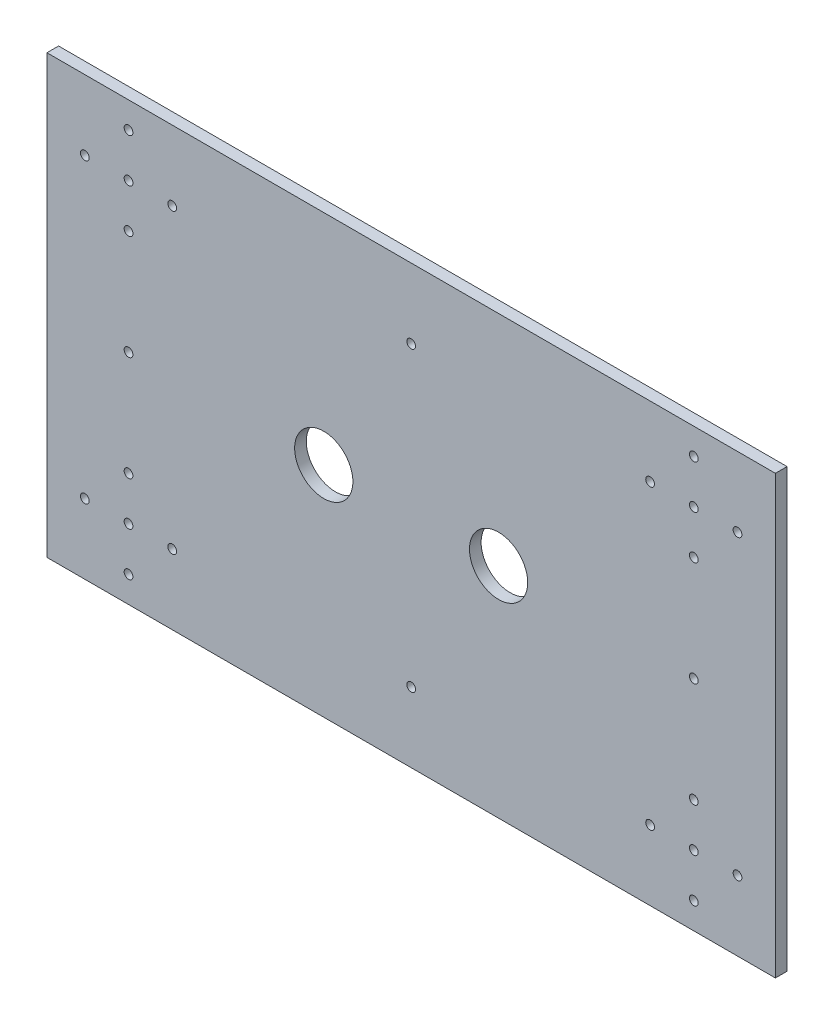
ISO-10303-21;
HEADER;
FILE_DESCRIPTION(('STEP AP214'),'2;1');
FILE_NAME('part.step','',(''),(''),'','','');
FILE_SCHEMA(('AUTOMOTIVE_DESIGN { 1 0 10303 214 1 1 1 1 }'));
ENDSEC;
DATA;
#1=APPLICATION_CONTEXT('core data for automotive mechanical design processes');
#2=APPLICATION_PROTOCOL_DEFINITION('international standard','automotive_design',2000,#1);
#3=PRODUCT_CONTEXT('',#1,'mechanical');
#4=PRODUCT('Part','Part','',(#3));
#5=PRODUCT_RELATED_PRODUCT_CATEGORY('part','',(#4));
#6=PRODUCT_DEFINITION_FORMATION('','',#4);
#7=PRODUCT_DEFINITION_CONTEXT('part definition',#1,'design');
#8=PRODUCT_DEFINITION('design','',#6,#7);
#9=PRODUCT_DEFINITION_SHAPE('','',#8);
#10=(LENGTH_UNIT() NAMED_UNIT(*) SI_UNIT(.MILLI.,.METRE.));
#11=(NAMED_UNIT(*) PLANE_ANGLE_UNIT() SI_UNIT($,.RADIAN.));
#12=(NAMED_UNIT(*) SI_UNIT($,.STERADIAN.) SOLID_ANGLE_UNIT());
#13=UNCERTAINTY_MEASURE_WITH_UNIT(LENGTH_MEASURE(1.E-05),#10,'distance_accuracy_value','');
#14=(GEOMETRIC_REPRESENTATION_CONTEXT(3) GLOBAL_UNCERTAINTY_ASSIGNED_CONTEXT((#13)) GLOBAL_UNIT_ASSIGNED_CONTEXT((#10,
#11,#12)) REPRESENTATION_CONTEXT('',''));
#15=CARTESIAN_POINT('',(0.,0.,0.));
#16=DIRECTION('',(0.,0.,1.));
#17=DIRECTION('',(1.,0.,0.));
#18=AXIS2_PLACEMENT_3D('',#15,#16,#17);
#19=CARTESIAN_POINT('',(0.,0.,4.));
#20=DIRECTION('',(0.,0.,1.));
#21=DIRECTION('',(1.,0.,0.));
#22=AXIS2_PLACEMENT_3D('',#19,#20,#21);
#23=PLANE('',#22);
#24=CARTESIAN_POINT('',(94.9015025860532,-41.1333333333333,4.));
#25=DIRECTION('',(0.,0.,1.));
#26=DIRECTION('',(1.,0.,0.));
#27=AXIS2_PLACEMENT_3D('',#24,#25,#26);
#28=CIRCLE('',#27,10.);
#29=CARTESIAN_POINT('',(104.901502586053,-41.1333333333333,4.));
#30=VERTEX_POINT('',#29);
#31=EDGE_CURVE('E253',#30,#30,#28,.T.);
#32=ORIENTED_EDGE('',*,*,#31,.F.);
#33=EDGE_LOOP('',(#32));
#34=FACE_BOUND('',#33,.T.);
#35=CARTESIAN_POINT('',(-32.098497413947,24.8666666666667,4.));
#36=DIRECTION('',(0.,0.,1.));
#37=DIRECTION('',(1.,0.,0.));
#38=AXIS2_PLACEMENT_3D('',#35,#36,#37);
#39=CIRCLE('',#38,1.50000000000001);
#40=CARTESIAN_POINT('',(-30.598497413947,24.8666666666667,4.));
#41=VERTEX_POINT('',#40);
#42=EDGE_CURVE('E241',#41,#41,#39,.T.);
#43=ORIENTED_EDGE('',*,*,#42,.F.);
#44=EDGE_LOOP('',(#43));
#45=FACE_BOUND('',#44,.T.);
#46=CARTESIAN_POINT('',(-32.0984974139472,-5.13333333333334,4.));
#47=DIRECTION('',(0.,0.,1.));
#48=DIRECTION('',(1.,0.,0.));
#49=AXIS2_PLACEMENT_3D('',#46,#47,#48);
#50=CIRCLE('',#49,1.5);
#51=CARTESIAN_POINT('',(-30.5984974139472,-5.13333333333334,4.));
#52=VERTEX_POINT('',#51);
#53=EDGE_CURVE('E229',#52,#52,#50,.T.);
#54=ORIENTED_EDGE('',*,*,#53,.F.);
#55=EDGE_LOOP('',(#54));
#56=FACE_BOUND('',#55,.T.);
#57=CARTESIAN_POINT('',(-32.0984974139472,9.86666666666666,4.));
#58=DIRECTION('',(0.,0.,1.));
#59=DIRECTION('',(1.,0.,0.));
#60=AXIS2_PLACEMENT_3D('',#57,#58,#59);
#61=CIRCLE('',#60,1.5);
#62=CARTESIAN_POINT('',(-30.5984974139472,9.86666666666666,4.));
#63=VERTEX_POINT('',#62);
#64=EDGE_CURVE('E217',#63,#63,#61,.T.);
#65=ORIENTED_EDGE('',*,*,#64,.F.);
#66=EDGE_LOOP('',(#65));
#67=FACE_BOUND('',#66,.T.);
#68=CARTESIAN_POINT('',(146.901502586053,9.86666666666676,4.));
#69=DIRECTION('',(0.,0.,1.));
#70=DIRECTION('',(1.,0.,0.));
#71=AXIS2_PLACEMENT_3D('',#68,#69,#70);
#72=CIRCLE('',#71,1.49999999999999);
#73=CARTESIAN_POINT('',(148.401502586053,9.86666666666676,4.));
#74=VERTEX_POINT('',#73);
#75=EDGE_CURVE('E205',#74,#74,#72,.T.);
#76=ORIENTED_EDGE('',*,*,#75,.F.);
#77=EDGE_LOOP('',(#76));
#78=FACE_BOUND('',#77,.T.);
#79=CARTESIAN_POINT('',(176.901502586053,9.86666666666666,4.));
#80=DIRECTION('',(0.,0.,1.));
#81=DIRECTION('',(1.,0.,0.));
#82=AXIS2_PLACEMENT_3D('',#79,#80,#81);
#83=CIRCLE('',#82,1.5);
#84=CARTESIAN_POINT('',(178.401502586053,9.86666666666666,4.));
#85=VERTEX_POINT('',#84);
#86=EDGE_CURVE('E193',#85,#85,#83,.T.);
#87=ORIENTED_EDGE('',*,*,#86,.F.);
#88=EDGE_LOOP('',(#87));
#89=FACE_BOUND('',#88,.T.);
#90=CARTESIAN_POINT('',(161.901502586053,-77.1333333333333,4.));
#91=DIRECTION('',(0.,0.,1.));
#92=DIRECTION('',(1.,0.,0.));
#93=AXIS2_PLACEMENT_3D('',#90,#91,#92);
#94=CIRCLE('',#93,1.5);
#95=CARTESIAN_POINT('',(163.401502586053,-77.1333333333333,4.));
#96=VERTEX_POINT('',#95);
#97=EDGE_CURVE('E181',#96,#96,#94,.T.);
#98=ORIENTED_EDGE('',*,*,#97,.F.);
#99=EDGE_LOOP('',(#98));
#100=FACE_BOUND('',#99,.T.);
#101=CARTESIAN_POINT('',(161.901502586053,-107.133333333333,4.));
#102=DIRECTION('',(0.,0.,1.));
#103=DIRECTION('',(1.,0.,0.));
#104=AXIS2_PLACEMENT_3D('',#101,#102,#103);
#105=CIRCLE('',#104,1.5);
#106=CARTESIAN_POINT('',(163.401502586053,-107.133333333333,4.));
#107=VERTEX_POINT('',#106);
#108=EDGE_CURVE('E169',#107,#107,#105,.T.);
#109=ORIENTED_EDGE('',*,*,#108,.F.);
#110=EDGE_LOOP('',(#109));
#111=FACE_BOUND('',#110,.T.);
#112=CARTESIAN_POINT('',(161.901502586053,-92.1333333333333,4.));
#113=DIRECTION('',(0.,0.,1.));
#114=DIRECTION('',(1.,0.,0.));
#115=AXIS2_PLACEMENT_3D('',#112,#113,#114);
#116=CIRCLE('',#115,1.5);
#117=CARTESIAN_POINT('',(163.401502586053,-92.1333333333333,4.));
#118=VERTEX_POINT('',#117);
#119=EDGE_CURVE('E157',#118,#118,#116,.T.);
#120=ORIENTED_EDGE('',*,*,#119,.F.);
#121=EDGE_LOOP('',(#120));
#122=FACE_BOUND('',#121,.T.);
#123=CARTESIAN_POINT('',(-32.0984974139467,-77.1333333333333,4.));
#124=DIRECTION('',(0.,0.,1.));
#125=DIRECTION('',(1.,0.,0.));
#126=AXIS2_PLACEMENT_3D('',#123,#124,#125);
#127=CIRCLE('',#126,1.50000000000001);
#128=CARTESIAN_POINT('',(-30.5984974139467,-77.1333333333333,4.));
#129=VERTEX_POINT('',#128);
#130=EDGE_CURVE('E145',#129,#129,#127,.T.);
#131=ORIENTED_EDGE('',*,*,#130,.F.);
#132=EDGE_LOOP('',(#131));
#133=FACE_BOUND('',#132,.T.);
#134=CARTESIAN_POINT('',(161.901502586053,-41.1333333333333,4.));
#135=DIRECTION('',(0.,0.,1.));
#136=DIRECTION('',(1.,0.,0.));
#137=AXIS2_PLACEMENT_3D('',#134,#135,#136);
#138=CIRCLE('',#137,1.5);
#139=CARTESIAN_POINT('',(163.401502586053,-41.1333333333333,4.));
#140=VERTEX_POINT('',#139);
#141=EDGE_CURVE('E133',#140,#140,#138,.T.);
#142=ORIENTED_EDGE('',*,*,#141,.F.);
#143=EDGE_LOOP('',(#142));
#144=FACE_BOUND('',#143,.T.);
#145=CARTESIAN_POINT('',(-17.0984974139468,-92.1333333333333,4.));
#146=DIRECTION('',(0.,0.,1.));
#147=DIRECTION('',(1.,0.,0.));
#148=AXIS2_PLACEMENT_3D('',#145,#146,#147);
#149=CIRCLE('',#148,1.5);
#150=CARTESIAN_POINT('',(-15.5984974139468,-92.1333333333333,4.));
#151=VERTEX_POINT('',#150);
#152=EDGE_CURVE('E121',#151,#151,#149,.T.);
#153=ORIENTED_EDGE('',*,*,#152,.F.);
#154=EDGE_LOOP('',(#153));
#155=FACE_BOUND('',#154,.T.);
#156=CARTESIAN_POINT('',(-32.0984974139472,-41.1333333333333,4.));
#157=DIRECTION('',(0.,0.,1.));
#158=DIRECTION('',(1.,0.,0.));
#159=AXIS2_PLACEMENT_3D('',#156,#157,#158);
#160=CIRCLE('',#159,1.5);
#161=CARTESIAN_POINT('',(-30.5984974139472,-41.1333333333333,4.));
#162=VERTEX_POINT('',#161);
#163=EDGE_CURVE('E100',#162,#162,#160,.T.);
#164=ORIENTED_EDGE('',*,*,#163,.F.);
#165=EDGE_LOOP('',(#164));
#166=FACE_BOUND('',#165,.T.);
#167=DIRECTION('',(0.,-1.,0.));
#168=VECTOR('',#167,1.);
#169=CARTESIAN_POINT('',(-60.0984974139469,33.8666666666667,4.));
#170=LINE('',#169,#168);
#171=CARTESIAN_POINT('',(-60.0984974139469,33.8666666666667,4.));
#172=VERTEX_POINT('',#171);
#173=CARTESIAN_POINT('',(-60.0984974139469,-116.133333333333,4.));
#174=VERTEX_POINT('',#173);
#175=EDGE_CURVE('E85',#172,#174,#170,.T.);
#176=ORIENTED_EDGE('',*,*,#175,.T.);
#177=DIRECTION('',(1.,0.,0.));
#178=VECTOR('',#177,1.);
#179=CARTESIAN_POINT('',(-60.0984974139469,-116.133333333333,4.));
#180=LINE('',#179,#178);
#181=CARTESIAN_POINT('',(189.901502586053,-116.133333333333,4.));
#182=VERTEX_POINT('',#181);
#183=EDGE_CURVE('E80',#174,#182,#180,.T.);
#184=ORIENTED_EDGE('',*,*,#183,.T.);
#185=DIRECTION('',(0.,1.,0.));
#186=VECTOR('',#185,1.);
#187=CARTESIAN_POINT('',(189.901502586053,33.8666666666667,4.));
#188=LINE('',#187,#186);
#189=CARTESIAN_POINT('',(189.901502586053,33.8666666666667,4.));
#190=VERTEX_POINT('',#189);
#191=EDGE_CURVE('E83',#182,#190,#188,.T.);
#192=ORIENTED_EDGE('',*,*,#191,.T.);
#193=DIRECTION('',(-1.,0.,0.));
#194=VECTOR('',#193,1.);
#195=CARTESIAN_POINT('',(-60.0984974139469,33.8666666666667,4.));
#196=LINE('',#195,#194);
#197=EDGE_CURVE('E50',#190,#172,#196,.T.);
#198=ORIENTED_EDGE('',*,*,#197,.T.);
#199=EDGE_LOOP('',(#176,#184,#192,#198));
#200=FACE_BOUND('',#199,.T.);
#201=CARTESIAN_POINT('',(-32.0984974139468,-92.1333333333333,4.));
#202=DIRECTION('',(0.,0.,1.));
#203=DIRECTION('',(1.,0.,0.));
#204=AXIS2_PLACEMENT_3D('',#201,#202,#203);
#205=CIRCLE('',#204,1.5);
#206=CARTESIAN_POINT('',(-30.5984974139468,-92.1333333333333,4.));
#207=VERTEX_POINT('',#206);
#208=EDGE_CURVE('E115',#207,#207,#205,.T.);
#209=ORIENTED_EDGE('',*,*,#208,.F.);
#210=EDGE_LOOP('',(#209));
#211=FACE_BOUND('',#210,.T.);
#212=CARTESIAN_POINT('',(-32.0984974139469,-107.133333333333,4.));
#213=DIRECTION('',(0.,0.,1.));
#214=DIRECTION('',(1.,0.,0.));
#215=AXIS2_PLACEMENT_3D('',#212,#213,#214);
#216=CIRCLE('',#215,1.5);
#217=CARTESIAN_POINT('',(-30.5984974139469,-107.133333333333,4.));
#218=VERTEX_POINT('',#217);
#219=EDGE_CURVE('E127',#218,#218,#216,.T.);
#220=ORIENTED_EDGE('',*,*,#219,.F.);
#221=EDGE_LOOP('',(#220));
#222=FACE_BOUND('',#221,.T.);
#223=CARTESIAN_POINT('',(-47.0984974139468,-92.1333333333332,4.));
#224=DIRECTION('',(0.,0.,1.));
#225=DIRECTION('',(1.,0.,0.));
#226=AXIS2_PLACEMENT_3D('',#223,#224,#225);
#227=CIRCLE('',#226,1.49999999999999);
#228=CARTESIAN_POINT('',(-45.5984974139468,-92.1333333333332,4.));
#229=VERTEX_POINT('',#228);
#230=EDGE_CURVE('E139',#229,#229,#227,.T.);
#231=ORIENTED_EDGE('',*,*,#230,.F.);
#232=EDGE_LOOP('',(#231));
#233=FACE_BOUND('',#232,.T.);
#234=CARTESIAN_POINT('',(64.9015025860531,9.86666666666666,4.));
#235=DIRECTION('',(0.,0.,1.));
#236=DIRECTION('',(1.,0.,0.));
#237=AXIS2_PLACEMENT_3D('',#234,#235,#236);
#238=CIRCLE('',#237,1.5);
#239=CARTESIAN_POINT('',(66.4015025860531,9.86666666666666,4.));
#240=VERTEX_POINT('',#239);
#241=EDGE_CURVE('E151',#240,#240,#238,.T.);
#242=ORIENTED_EDGE('',*,*,#241,.F.);
#243=EDGE_LOOP('',(#242));
#244=FACE_BOUND('',#243,.T.);
#245=CARTESIAN_POINT('',(176.901502586053,-92.1333333333333,4.));
#246=DIRECTION('',(0.,0.,1.));
#247=DIRECTION('',(1.,0.,0.));
#248=AXIS2_PLACEMENT_3D('',#245,#246,#247);
#249=CIRCLE('',#248,1.5);
#250=CARTESIAN_POINT('',(178.401502586053,-92.1333333333333,4.));
#251=VERTEX_POINT('',#250);
#252=EDGE_CURVE('E163',#251,#251,#249,.T.);
#253=ORIENTED_EDGE('',*,*,#252,.F.);
#254=EDGE_LOOP('',(#253));
#255=FACE_BOUND('',#254,.T.);
#256=CARTESIAN_POINT('',(146.901502586053,-92.1333333333332,4.));
#257=DIRECTION('',(0.,0.,1.));
#258=DIRECTION('',(1.,0.,0.));
#259=AXIS2_PLACEMENT_3D('',#256,#257,#258);
#260=CIRCLE('',#259,1.49999999999999);
#261=CARTESIAN_POINT('',(148.401502586053,-92.1333333333332,4.));
#262=VERTEX_POINT('',#261);
#263=EDGE_CURVE('E175',#262,#262,#260,.T.);
#264=ORIENTED_EDGE('',*,*,#263,.F.);
#265=EDGE_LOOP('',(#264));
#266=FACE_BOUND('',#265,.T.);
#267=CARTESIAN_POINT('',(161.901502586053,9.86666666666666,4.));
#268=DIRECTION('',(0.,0.,1.));
#269=DIRECTION('',(1.,0.,0.));
#270=AXIS2_PLACEMENT_3D('',#267,#268,#269);
#271=CIRCLE('',#270,1.50000000000002);
#272=CARTESIAN_POINT('',(163.401502586053,9.86666666666666,4.));
#273=VERTEX_POINT('',#272);
#274=EDGE_CURVE('E187',#273,#273,#271,.T.);
#275=ORIENTED_EDGE('',*,*,#274,.F.);
#276=EDGE_LOOP('',(#275));
#277=FACE_BOUND('',#276,.T.);
#278=CARTESIAN_POINT('',(161.901502586053,-5.13333333333334,4.));
#279=DIRECTION('',(0.,0.,1.));
#280=DIRECTION('',(1.,0.,0.));
#281=AXIS2_PLACEMENT_3D('',#278,#279,#280);
#282=CIRCLE('',#281,1.5);
#283=CARTESIAN_POINT('',(163.401502586053,-5.13333333333334,4.));
#284=VERTEX_POINT('',#283);
#285=EDGE_CURVE('E199',#284,#284,#282,.T.);
#286=ORIENTED_EDGE('',*,*,#285,.F.);
#287=EDGE_LOOP('',(#286));
#288=FACE_BOUND('',#287,.T.);
#289=CARTESIAN_POINT('',(161.901502586053,24.8666666666667,4.));
#290=DIRECTION('',(0.,0.,1.));
#291=DIRECTION('',(1.,0.,0.));
#292=AXIS2_PLACEMENT_3D('',#289,#290,#291);
#293=CIRCLE('',#292,1.50000000000001);
#294=CARTESIAN_POINT('',(163.401502586053,24.8666666666667,4.));
#295=VERTEX_POINT('',#294);
#296=EDGE_CURVE('E211',#295,#295,#293,.T.);
#297=ORIENTED_EDGE('',*,*,#296,.F.);
#298=EDGE_LOOP('',(#297));
#299=FACE_BOUND('',#298,.T.);
#300=CARTESIAN_POINT('',(-17.0984974139472,9.86666666666666,4.));
#301=DIRECTION('',(0.,0.,1.));
#302=DIRECTION('',(1.,0.,0.));
#303=AXIS2_PLACEMENT_3D('',#300,#301,#302);
#304=CIRCLE('',#303,1.5);
#305=CARTESIAN_POINT('',(-15.5984974139472,9.86666666666666,4.));
#306=VERTEX_POINT('',#305);
#307=EDGE_CURVE('E223',#306,#306,#304,.T.);
#308=ORIENTED_EDGE('',*,*,#307,.F.);
#309=EDGE_LOOP('',(#308));
#310=FACE_BOUND('',#309,.T.);
#311=CARTESIAN_POINT('',(-47.0984974139472,9.86666666666676,4.));
#312=DIRECTION('',(0.,0.,1.));
#313=DIRECTION('',(1.,0.,0.));
#314=AXIS2_PLACEMENT_3D('',#311,#312,#313);
#315=CIRCLE('',#314,1.49999999999999);
#316=CARTESIAN_POINT('',(-45.5984974139472,9.86666666666676,4.));
#317=VERTEX_POINT('',#316);
#318=EDGE_CURVE('E235',#317,#317,#315,.T.);
#319=ORIENTED_EDGE('',*,*,#318,.F.);
#320=EDGE_LOOP('',(#319));
#321=FACE_BOUND('',#320,.T.);
#322=CARTESIAN_POINT('',(64.9015025860542,-92.1333333333333,4.));
#323=DIRECTION('',(0.,0.,1.));
#324=DIRECTION('',(1.,0.,0.));
#325=AXIS2_PLACEMENT_3D('',#322,#323,#324);
#326=CIRCLE('',#325,1.5);
#327=CARTESIAN_POINT('',(66.4015025860542,-92.1333333333333,4.));
#328=VERTEX_POINT('',#327);
#329=EDGE_CURVE('E247',#328,#328,#326,.T.);
#330=ORIENTED_EDGE('',*,*,#329,.F.);
#331=EDGE_LOOP('',(#330));
#332=FACE_BOUND('',#331,.T.);
#333=CARTESIAN_POINT('',(34.9015025860531,-41.1333333333333,4.));
#334=DIRECTION('',(0.,0.,1.));
#335=DIRECTION('',(-1.,0.,0.));
#336=AXIS2_PLACEMENT_3D('',#333,#334,#335);
#337=CIRCLE('',#336,10.);
#338=CARTESIAN_POINT('',(24.9015025860531,-41.1333333333333,4.));
#339=VERTEX_POINT('',#338);
#340=EDGE_CURVE('E259',#339,#339,#337,.T.);
#341=ORIENTED_EDGE('',*,*,#340,.F.);
#342=EDGE_LOOP('',(#341));
#343=FACE_BOUND('',#342,.T.);
#344=ADVANCED_FACE('F33',(#34,#45,#56,#67,#78,#89,#100,#111,#122,#133,#144,#155,#166,#200,#211,
#222,#233,#244,#255,#266,#277,#288,#299,#310,#321,#332,#343),#23,.T.);
#345=CARTESIAN_POINT('',(0.,0.,0.));
#346=DIRECTION('',(0.,0.,1.));
#347=DIRECTION('',(1.,0.,0.));
#348=AXIS2_PLACEMENT_3D('',#345,#346,#347);
#349=PLANE('',#348);
#350=DIRECTION('',(0.,-1.,0.));
#351=VECTOR('',#350,1.);
#352=CARTESIAN_POINT('',(-60.0984974139469,33.8666666666667,0.));
#353=LINE('',#352,#351);
#354=CARTESIAN_POINT('',(-60.0984974139469,33.8666666666667,0.));
#355=VERTEX_POINT('',#354);
#356=CARTESIAN_POINT('',(-60.0984974139469,-116.133333333333,0.));
#357=VERTEX_POINT('',#356);
#358=EDGE_CURVE('E97',#355,#357,#353,.T.);
#359=ORIENTED_EDGE('',*,*,#358,.F.);
#360=DIRECTION('',(-1.,0.,0.));
#361=VECTOR('',#360,1.);
#362=CARTESIAN_POINT('',(-60.0984974139469,33.8666666666667,0.));
#363=LINE('',#362,#361);
#364=CARTESIAN_POINT('',(189.901502586053,33.8666666666667,0.));
#365=VERTEX_POINT('',#364);
#366=EDGE_CURVE('E73',#365,#355,#363,.T.);
#367=ORIENTED_EDGE('',*,*,#366,.F.);
#368=DIRECTION('',(0.,1.,0.));
#369=VECTOR('',#368,1.);
#370=CARTESIAN_POINT('',(189.901502586053,33.8666666666667,0.));
#371=LINE('',#370,#369);
#372=CARTESIAN_POINT('',(189.901502586053,-116.133333333333,0.));
#373=VERTEX_POINT('',#372);
#374=EDGE_CURVE('E67',#373,#365,#371,.T.);
#375=ORIENTED_EDGE('',*,*,#374,.F.);
#376=DIRECTION('',(1.,0.,0.));
#377=VECTOR('',#376,1.);
#378=CARTESIAN_POINT('',(-60.0984974139469,-116.133333333333,0.));
#379=LINE('',#378,#377);
#380=EDGE_CURVE('E89',#357,#373,#379,.T.);
#381=ORIENTED_EDGE('',*,*,#380,.F.);
#382=EDGE_LOOP('',(#359,#367,#375,#381));
#383=FACE_BOUND('',#382,.T.);
#384=CARTESIAN_POINT('',(-32.0984974139472,-41.1333333333333,0.));
#385=DIRECTION('',(0.,0.,1.));
#386=DIRECTION('',(1.,0.,0.));
#387=AXIS2_PLACEMENT_3D('',#384,#385,#386);
#388=CIRCLE('',#387,1.5);
#389=CARTESIAN_POINT('',(-30.5984974139472,-41.1333333333333,0.));
#390=VERTEX_POINT('',#389);
#391=EDGE_CURVE('E112',#390,#390,#388,.T.);
#392=ORIENTED_EDGE('',*,*,#391,.T.);
#393=EDGE_LOOP('',(#392));
#394=FACE_BOUND('',#393,.T.);
#395=CARTESIAN_POINT('',(-32.0984974139468,-92.1333333333333,0.));
#396=DIRECTION('',(0.,0.,1.));
#397=DIRECTION('',(1.,0.,0.));
#398=AXIS2_PLACEMENT_3D('',#395,#396,#397);
#399=CIRCLE('',#398,1.5);
#400=CARTESIAN_POINT('',(-30.5984974139468,-92.1333333333333,0.));
#401=VERTEX_POINT('',#400);
#402=EDGE_CURVE('E118',#401,#401,#399,.T.);
#403=ORIENTED_EDGE('',*,*,#402,.T.);
#404=EDGE_LOOP('',(#403));
#405=FACE_BOUND('',#404,.T.);
#406=CARTESIAN_POINT('',(-17.0984974139468,-92.1333333333333,0.));
#407=DIRECTION('',(0.,0.,1.));
#408=DIRECTION('',(1.,0.,0.));
#409=AXIS2_PLACEMENT_3D('',#406,#407,#408);
#410=CIRCLE('',#409,1.5);
#411=CARTESIAN_POINT('',(-15.5984974139468,-92.1333333333333,0.));
#412=VERTEX_POINT('',#411);
#413=EDGE_CURVE('E124',#412,#412,#410,.T.);
#414=ORIENTED_EDGE('',*,*,#413,.T.);
#415=EDGE_LOOP('',(#414));
#416=FACE_BOUND('',#415,.T.);
#417=CARTESIAN_POINT('',(-32.0984974139469,-107.133333333333,0.));
#418=DIRECTION('',(0.,0.,1.));
#419=DIRECTION('',(1.,0.,0.));
#420=AXIS2_PLACEMENT_3D('',#417,#418,#419);
#421=CIRCLE('',#420,1.5);
#422=CARTESIAN_POINT('',(-30.5984974139469,-107.133333333333,0.));
#423=VERTEX_POINT('',#422);
#424=EDGE_CURVE('E130',#423,#423,#421,.T.);
#425=ORIENTED_EDGE('',*,*,#424,.T.);
#426=EDGE_LOOP('',(#425));
#427=FACE_BOUND('',#426,.T.);
#428=CARTESIAN_POINT('',(161.901502586053,-41.1333333333333,0.));
#429=DIRECTION('',(0.,0.,1.));
#430=DIRECTION('',(1.,0.,0.));
#431=AXIS2_PLACEMENT_3D('',#428,#429,#430);
#432=CIRCLE('',#431,1.5);
#433=CARTESIAN_POINT('',(163.401502586053,-41.1333333333333,0.));
#434=VERTEX_POINT('',#433);
#435=EDGE_CURVE('E136',#434,#434,#432,.T.);
#436=ORIENTED_EDGE('',*,*,#435,.T.);
#437=EDGE_LOOP('',(#436));
#438=FACE_BOUND('',#437,.T.);
#439=CARTESIAN_POINT('',(-47.0984974139468,-92.1333333333332,0.));
#440=DIRECTION('',(0.,0.,1.));
#441=DIRECTION('',(1.,0.,0.));
#442=AXIS2_PLACEMENT_3D('',#439,#440,#441);
#443=CIRCLE('',#442,1.49999999999999);
#444=CARTESIAN_POINT('',(-45.5984974139468,-92.1333333333332,0.));
#445=VERTEX_POINT('',#444);
#446=EDGE_CURVE('E142',#445,#445,#443,.T.);
#447=ORIENTED_EDGE('',*,*,#446,.T.);
#448=EDGE_LOOP('',(#447));
#449=FACE_BOUND('',#448,.T.);
#450=CARTESIAN_POINT('',(-32.0984974139467,-77.1333333333333,0.));
#451=DIRECTION('',(0.,0.,1.));
#452=DIRECTION('',(1.,0.,0.));
#453=AXIS2_PLACEMENT_3D('',#450,#451,#452);
#454=CIRCLE('',#453,1.50000000000001);
#455=CARTESIAN_POINT('',(-30.5984974139467,-77.1333333333333,0.));
#456=VERTEX_POINT('',#455);
#457=EDGE_CURVE('E148',#456,#456,#454,.T.);
#458=ORIENTED_EDGE('',*,*,#457,.T.);
#459=EDGE_LOOP('',(#458));
#460=FACE_BOUND('',#459,.T.);
#461=CARTESIAN_POINT('',(64.9015025860531,9.86666666666666,0.));
#462=DIRECTION('',(0.,0.,1.));
#463=DIRECTION('',(1.,0.,0.));
#464=AXIS2_PLACEMENT_3D('',#461,#462,#463);
#465=CIRCLE('',#464,1.5);
#466=CARTESIAN_POINT('',(66.4015025860531,9.86666666666666,0.));
#467=VERTEX_POINT('',#466);
#468=EDGE_CURVE('E154',#467,#467,#465,.T.);
#469=ORIENTED_EDGE('',*,*,#468,.T.);
#470=EDGE_LOOP('',(#469));
#471=FACE_BOUND('',#470,.T.);
#472=CARTESIAN_POINT('',(161.901502586053,-92.1333333333333,0.));
#473=DIRECTION('',(0.,0.,1.));
#474=DIRECTION('',(1.,0.,0.));
#475=AXIS2_PLACEMENT_3D('',#472,#473,#474);
#476=CIRCLE('',#475,1.5);
#477=CARTESIAN_POINT('',(163.401502586053,-92.1333333333333,0.));
#478=VERTEX_POINT('',#477);
#479=EDGE_CURVE('E160',#478,#478,#476,.T.);
#480=ORIENTED_EDGE('',*,*,#479,.T.);
#481=EDGE_LOOP('',(#480));
#482=FACE_BOUND('',#481,.T.);
#483=CARTESIAN_POINT('',(176.901502586053,-92.1333333333333,0.));
#484=DIRECTION('',(0.,0.,1.));
#485=DIRECTION('',(1.,0.,0.));
#486=AXIS2_PLACEMENT_3D('',#483,#484,#485);
#487=CIRCLE('',#486,1.5);
#488=CARTESIAN_POINT('',(178.401502586053,-92.1333333333333,0.));
#489=VERTEX_POINT('',#488);
#490=EDGE_CURVE('E166',#489,#489,#487,.T.);
#491=ORIENTED_EDGE('',*,*,#490,.T.);
#492=EDGE_LOOP('',(#491));
#493=FACE_BOUND('',#492,.T.);
#494=CARTESIAN_POINT('',(161.901502586053,-107.133333333333,0.));
#495=DIRECTION('',(0.,0.,1.));
#496=DIRECTION('',(1.,0.,0.));
#497=AXIS2_PLACEMENT_3D('',#494,#495,#496);
#498=CIRCLE('',#497,1.5);
#499=CARTESIAN_POINT('',(163.401502586053,-107.133333333333,0.));
#500=VERTEX_POINT('',#499);
#501=EDGE_CURVE('E172',#500,#500,#498,.T.);
#502=ORIENTED_EDGE('',*,*,#501,.T.);
#503=EDGE_LOOP('',(#502));
#504=FACE_BOUND('',#503,.T.);
#505=CARTESIAN_POINT('',(146.901502586053,-92.1333333333332,0.));
#506=DIRECTION('',(0.,0.,1.));
#507=DIRECTION('',(1.,0.,0.));
#508=AXIS2_PLACEMENT_3D('',#505,#506,#507);
#509=CIRCLE('',#508,1.49999999999999);
#510=CARTESIAN_POINT('',(148.401502586053,-92.1333333333332,0.));
#511=VERTEX_POINT('',#510);
#512=EDGE_CURVE('E178',#511,#511,#509,.T.);
#513=ORIENTED_EDGE('',*,*,#512,.T.);
#514=EDGE_LOOP('',(#513));
#515=FACE_BOUND('',#514,.T.);
#516=CARTESIAN_POINT('',(161.901502586053,-77.1333333333333,0.));
#517=DIRECTION('',(0.,0.,1.));
#518=DIRECTION('',(1.,0.,0.));
#519=AXIS2_PLACEMENT_3D('',#516,#517,#518);
#520=CIRCLE('',#519,1.5);
#521=CARTESIAN_POINT('',(163.401502586053,-77.1333333333333,0.));
#522=VERTEX_POINT('',#521);
#523=EDGE_CURVE('E184',#522,#522,#520,.T.);
#524=ORIENTED_EDGE('',*,*,#523,.T.);
#525=EDGE_LOOP('',(#524));
#526=FACE_BOUND('',#525,.T.);
#527=CARTESIAN_POINT('',(161.901502586053,9.86666666666666,0.));
#528=DIRECTION('',(0.,0.,1.));
#529=DIRECTION('',(1.,0.,0.));
#530=AXIS2_PLACEMENT_3D('',#527,#528,#529);
#531=CIRCLE('',#530,1.50000000000002);
#532=CARTESIAN_POINT('',(163.401502586053,9.86666666666666,0.));
#533=VERTEX_POINT('',#532);
#534=EDGE_CURVE('E190',#533,#533,#531,.T.);
#535=ORIENTED_EDGE('',*,*,#534,.T.);
#536=EDGE_LOOP('',(#535));
#537=FACE_BOUND('',#536,.T.);
#538=CARTESIAN_POINT('',(176.901502586053,9.86666666666666,0.));
#539=DIRECTION('',(0.,0.,1.));
#540=DIRECTION('',(1.,0.,0.));
#541=AXIS2_PLACEMENT_3D('',#538,#539,#540);
#542=CIRCLE('',#541,1.5);
#543=CARTESIAN_POINT('',(178.401502586053,9.86666666666666,0.));
#544=VERTEX_POINT('',#543);
#545=EDGE_CURVE('E196',#544,#544,#542,.T.);
#546=ORIENTED_EDGE('',*,*,#545,.T.);
#547=EDGE_LOOP('',(#546));
#548=FACE_BOUND('',#547,.T.);
#549=CARTESIAN_POINT('',(161.901502586053,-5.13333333333334,0.));
#550=DIRECTION('',(0.,0.,1.));
#551=DIRECTION('',(1.,0.,0.));
#552=AXIS2_PLACEMENT_3D('',#549,#550,#551);
#553=CIRCLE('',#552,1.5);
#554=CARTESIAN_POINT('',(163.401502586053,-5.13333333333334,0.));
#555=VERTEX_POINT('',#554);
#556=EDGE_CURVE('E202',#555,#555,#553,.T.);
#557=ORIENTED_EDGE('',*,*,#556,.T.);
#558=EDGE_LOOP('',(#557));
#559=FACE_BOUND('',#558,.T.);
#560=CARTESIAN_POINT('',(146.901502586053,9.86666666666676,0.));
#561=DIRECTION('',(0.,0.,1.));
#562=DIRECTION('',(1.,0.,0.));
#563=AXIS2_PLACEMENT_3D('',#560,#561,#562);
#564=CIRCLE('',#563,1.49999999999999);
#565=CARTESIAN_POINT('',(148.401502586053,9.86666666666676,0.));
#566=VERTEX_POINT('',#565);
#567=EDGE_CURVE('E208',#566,#566,#564,.T.);
#568=ORIENTED_EDGE('',*,*,#567,.T.);
#569=EDGE_LOOP('',(#568));
#570=FACE_BOUND('',#569,.T.);
#571=CARTESIAN_POINT('',(161.901502586053,24.8666666666667,0.));
#572=DIRECTION('',(0.,0.,1.));
#573=DIRECTION('',(1.,0.,0.));
#574=AXIS2_PLACEMENT_3D('',#571,#572,#573);
#575=CIRCLE('',#574,1.50000000000001);
#576=CARTESIAN_POINT('',(163.401502586053,24.8666666666667,0.));
#577=VERTEX_POINT('',#576);
#578=EDGE_CURVE('E214',#577,#577,#575,.T.);
#579=ORIENTED_EDGE('',*,*,#578,.T.);
#580=EDGE_LOOP('',(#579));
#581=FACE_BOUND('',#580,.T.);
#582=CARTESIAN_POINT('',(-32.0984974139472,9.86666666666666,0.));
#583=DIRECTION('',(0.,0.,1.));
#584=DIRECTION('',(1.,0.,0.));
#585=AXIS2_PLACEMENT_3D('',#582,#583,#584);
#586=CIRCLE('',#585,1.5);
#587=CARTESIAN_POINT('',(-30.5984974139472,9.86666666666666,0.));
#588=VERTEX_POINT('',#587);
#589=EDGE_CURVE('E220',#588,#588,#586,.T.);
#590=ORIENTED_EDGE('',*,*,#589,.T.);
#591=EDGE_LOOP('',(#590));
#592=FACE_BOUND('',#591,.T.);
#593=CARTESIAN_POINT('',(-17.0984974139472,9.86666666666666,0.));
#594=DIRECTION('',(0.,0.,1.));
#595=DIRECTION('',(1.,0.,0.));
#596=AXIS2_PLACEMENT_3D('',#593,#594,#595);
#597=CIRCLE('',#596,1.5);
#598=CARTESIAN_POINT('',(-15.5984974139472,9.86666666666666,0.));
#599=VERTEX_POINT('',#598);
#600=EDGE_CURVE('E226',#599,#599,#597,.T.);
#601=ORIENTED_EDGE('',*,*,#600,.T.);
#602=EDGE_LOOP('',(#601));
#603=FACE_BOUND('',#602,.T.);
#604=CARTESIAN_POINT('',(-32.0984974139472,-5.13333333333334,0.));
#605=DIRECTION('',(0.,0.,1.));
#606=DIRECTION('',(1.,0.,0.));
#607=AXIS2_PLACEMENT_3D('',#604,#605,#606);
#608=CIRCLE('',#607,1.5);
#609=CARTESIAN_POINT('',(-30.5984974139472,-5.13333333333334,0.));
#610=VERTEX_POINT('',#609);
#611=EDGE_CURVE('E232',#610,#610,#608,.T.);
#612=ORIENTED_EDGE('',*,*,#611,.T.);
#613=EDGE_LOOP('',(#612));
#614=FACE_BOUND('',#613,.T.);
#615=CARTESIAN_POINT('',(-47.0984974139472,9.86666666666676,0.));
#616=DIRECTION('',(0.,0.,1.));
#617=DIRECTION('',(1.,0.,0.));
#618=AXIS2_PLACEMENT_3D('',#615,#616,#617);
#619=CIRCLE('',#618,1.49999999999999);
#620=CARTESIAN_POINT('',(-45.5984974139472,9.86666666666676,0.));
#621=VERTEX_POINT('',#620);
#622=EDGE_CURVE('E238',#621,#621,#619,.T.);
#623=ORIENTED_EDGE('',*,*,#622,.T.);
#624=EDGE_LOOP('',(#623));
#625=FACE_BOUND('',#624,.T.);
#626=CARTESIAN_POINT('',(-32.098497413947,24.8666666666667,0.));
#627=DIRECTION('',(0.,0.,1.));
#628=DIRECTION('',(1.,0.,0.));
#629=AXIS2_PLACEMENT_3D('',#626,#627,#628);
#630=CIRCLE('',#629,1.50000000000001);
#631=CARTESIAN_POINT('',(-30.598497413947,24.8666666666667,0.));
#632=VERTEX_POINT('',#631);
#633=EDGE_CURVE('E244',#632,#632,#630,.T.);
#634=ORIENTED_EDGE('',*,*,#633,.T.);
#635=EDGE_LOOP('',(#634));
#636=FACE_BOUND('',#635,.T.);
#637=CARTESIAN_POINT('',(64.9015025860542,-92.1333333333333,0.));
#638=DIRECTION('',(0.,0.,1.));
#639=DIRECTION('',(1.,0.,0.));
#640=AXIS2_PLACEMENT_3D('',#637,#638,#639);
#641=CIRCLE('',#640,1.5);
#642=CARTESIAN_POINT('',(66.4015025860542,-92.1333333333333,0.));
#643=VERTEX_POINT('',#642);
#644=EDGE_CURVE('E250',#643,#643,#641,.T.);
#645=ORIENTED_EDGE('',*,*,#644,.T.);
#646=EDGE_LOOP('',(#645));
#647=FACE_BOUND('',#646,.T.);
#648=CARTESIAN_POINT('',(94.9015025860532,-41.1333333333333,0.));
#649=DIRECTION('',(0.,0.,1.));
#650=DIRECTION('',(1.,0.,0.));
#651=AXIS2_PLACEMENT_3D('',#648,#649,#650);
#652=CIRCLE('',#651,10.);
#653=CARTESIAN_POINT('',(104.901502586053,-41.1333333333333,0.));
#654=VERTEX_POINT('',#653);
#655=EDGE_CURVE('E256',#654,#654,#652,.T.);
#656=ORIENTED_EDGE('',*,*,#655,.T.);
#657=EDGE_LOOP('',(#656));
#658=FACE_BOUND('',#657,.T.);
#659=CARTESIAN_POINT('',(34.9015025860531,-41.1333333333333,0.));
#660=DIRECTION('',(0.,0.,1.));
#661=DIRECTION('',(-1.,0.,0.));
#662=AXIS2_PLACEMENT_3D('',#659,#660,#661);
#663=CIRCLE('',#662,10.);
#664=CARTESIAN_POINT('',(24.9015025860531,-41.1333333333333,0.));
#665=VERTEX_POINT('',#664);
#666=EDGE_CURVE('E262',#665,#665,#663,.T.);
#667=ORIENTED_EDGE('',*,*,#666,.T.);
#668=EDGE_LOOP('',(#667));
#669=FACE_BOUND('',#668,.T.);
#670=ADVANCED_FACE('F108',(#383,#394,#405,#416,#427,#438,#449,#460,#471,#482,#493,#504,#515,
#526,#537,#548,#559,#570,#581,#592,#603,#614,#625,#636,#647,#658,#669),#349,.F.);
#671=CARTESIAN_POINT('',(-60.0984974139469,33.8666666666667,4.));
#672=DIRECTION('',(1.,0.,0.));
#673=DIRECTION('',(0.,0.,-1.));
#674=AXIS2_PLACEMENT_3D('',#671,#672,#673);
#675=PLANE('',#674);
#676=ORIENTED_EDGE('',*,*,#358,.T.);
#677=DIRECTION('',(0.,0.,-1.));
#678=VECTOR('',#677,1.);
#679=CARTESIAN_POINT('',(-60.0984974139469,-116.133333333333,4.));
#680=LINE('',#679,#678);
#681=EDGE_CURVE('E11',#174,#357,#680,.T.);
#682=ORIENTED_EDGE('',*,*,#681,.F.);
#683=ORIENTED_EDGE('',*,*,#175,.F.);
#684=DIRECTION('',(0.,0.,-1.));
#685=VECTOR('',#684,1.);
#686=CARTESIAN_POINT('',(-60.0984974139469,33.8666666666667,4.));
#687=LINE('',#686,#685);
#688=EDGE_CURVE('E93',#172,#355,#687,.T.);
#689=ORIENTED_EDGE('',*,*,#688,.T.);
#690=EDGE_LOOP('',(#676,#682,#683,#689));
#691=FACE_BOUND('',#690,.T.);
#692=ADVANCED_FACE('F35',(#691),#675,.F.);
#693=CARTESIAN_POINT('',(-60.0984974139469,-116.133333333333,4.));
#694=DIRECTION('',(0.,1.,0.));
#695=DIRECTION('',(0.,0.,1.));
#696=AXIS2_PLACEMENT_3D('',#693,#694,#695);
#697=PLANE('',#696);
#698=ORIENTED_EDGE('',*,*,#380,.T.);
#699=DIRECTION('',(0.,0.,-1.));
#700=VECTOR('',#699,1.);
#701=CARTESIAN_POINT('',(189.901502586053,-116.133333333333,4.));
#702=LINE('',#701,#700);
#703=EDGE_CURVE('E42',#182,#373,#702,.T.);
#704=ORIENTED_EDGE('',*,*,#703,.F.);
#705=ORIENTED_EDGE('',*,*,#183,.F.);
#706=ORIENTED_EDGE('',*,*,#681,.T.);
#707=EDGE_LOOP('',(#698,#704,#705,#706));
#708=FACE_BOUND('',#707,.T.);
#709=ADVANCED_FACE('F88',(#708),#697,.F.);
#710=CARTESIAN_POINT('',(189.901502586053,33.8666666666667,4.));
#711=DIRECTION('',(-1.,0.,0.));
#712=DIRECTION('',(0.,-1.,0.));
#713=AXIS2_PLACEMENT_3D('',#710,#711,#712);
#714=PLANE('',#713);
#715=ORIENTED_EDGE('',*,*,#374,.T.);
#716=DIRECTION('',(0.,0.,-1.));
#717=VECTOR('',#716,1.);
#718=CARTESIAN_POINT('',(189.901502586053,33.8666666666667,4.));
#719=LINE('',#718,#717);
#720=EDGE_CURVE('E90',#190,#365,#719,.T.);
#721=ORIENTED_EDGE('',*,*,#720,.F.);
#722=ORIENTED_EDGE('',*,*,#191,.F.);
#723=ORIENTED_EDGE('',*,*,#703,.T.);
#724=EDGE_LOOP('',(#715,#721,#722,#723));
#725=FACE_BOUND('',#724,.T.);
#726=ADVANCED_FACE('F91',(#725),#714,.F.);
#727=CARTESIAN_POINT('',(-60.0984974139469,33.8666666666667,4.));
#728=DIRECTION('',(0.,-1.,0.));
#729=DIRECTION('',(0.,0.,-1.));
#730=AXIS2_PLACEMENT_3D('',#727,#728,#729);
#731=PLANE('',#730);
#732=ORIENTED_EDGE('',*,*,#366,.T.);
#733=ORIENTED_EDGE('',*,*,#688,.F.);
#734=ORIENTED_EDGE('',*,*,#197,.F.);
#735=ORIENTED_EDGE('',*,*,#720,.T.);
#736=EDGE_LOOP('',(#732,#733,#734,#735));
#737=FACE_BOUND('',#736,.T.);
#738=ADVANCED_FACE('F105',(#737),#731,.F.);
#739=CARTESIAN_POINT('',(-32.0984974139472,-41.1333333333333,4.));
#740=DIRECTION('',(0.,0.,-1.));
#741=DIRECTION('',(-1.,0.,0.));
#742=AXIS2_PLACEMENT_3D('',#739,#740,#741);
#743=CYLINDRICAL_SURFACE('',#742,1.5);
#744=ORIENTED_EDGE('',*,*,#163,.T.);
#745=EDGE_LOOP('',(#744));
#746=FACE_BOUND('',#745,.T.);
#747=ORIENTED_EDGE('',*,*,#391,.F.);
#748=EDGE_LOOP('',(#747));
#749=FACE_BOUND('',#748,.T.);
#750=ADVANCED_FACE('F281',(#746,#749),#743,.F.);
#751=CARTESIAN_POINT('',(-32.0984974139468,-92.1333333333333,4.));
#752=DIRECTION('',(0.,0.,-1.));
#753=DIRECTION('',(-1.,0.,0.));
#754=AXIS2_PLACEMENT_3D('',#751,#752,#753);
#755=CYLINDRICAL_SURFACE('',#754,1.5);
#756=ORIENTED_EDGE('',*,*,#208,.T.);
#757=EDGE_LOOP('',(#756));
#758=FACE_BOUND('',#757,.T.);
#759=ORIENTED_EDGE('',*,*,#402,.F.);
#760=EDGE_LOOP('',(#759));
#761=FACE_BOUND('',#760,.T.);
#762=ADVANCED_FACE('F327',(#758,#761),#755,.F.);
#763=CARTESIAN_POINT('',(-17.0984974139468,-92.1333333333333,4.));
#764=DIRECTION('',(0.,0.,-1.));
#765=DIRECTION('',(-1.,0.,0.));
#766=AXIS2_PLACEMENT_3D('',#763,#764,#765);
#767=CYLINDRICAL_SURFACE('',#766,1.5);
#768=ORIENTED_EDGE('',*,*,#152,.T.);
#769=EDGE_LOOP('',(#768));
#770=FACE_BOUND('',#769,.T.);
#771=ORIENTED_EDGE('',*,*,#413,.F.);
#772=EDGE_LOOP('',(#771));
#773=FACE_BOUND('',#772,.T.);
#774=ADVANCED_FACE('F335',(#770,#773),#767,.F.);
#775=CARTESIAN_POINT('',(-32.0984974139469,-107.133333333333,4.));
#776=DIRECTION('',(0.,0.,-1.));
#777=DIRECTION('',(-1.,0.,0.));
#778=AXIS2_PLACEMENT_3D('',#775,#776,#777);
#779=CYLINDRICAL_SURFACE('',#778,1.5);
#780=ORIENTED_EDGE('',*,*,#219,.T.);
#781=EDGE_LOOP('',(#780));
#782=FACE_BOUND('',#781,.T.);
#783=ORIENTED_EDGE('',*,*,#424,.F.);
#784=EDGE_LOOP('',(#783));
#785=FACE_BOUND('',#784,.T.);
#786=ADVANCED_FACE('F343',(#782,#785),#779,.F.);
#787=CARTESIAN_POINT('',(161.901502586053,-41.1333333333333,4.));
#788=DIRECTION('',(0.,0.,-1.));
#789=DIRECTION('',(-1.,0.,0.));
#790=AXIS2_PLACEMENT_3D('',#787,#788,#789);
#791=CYLINDRICAL_SURFACE('',#790,1.5);
#792=ORIENTED_EDGE('',*,*,#141,.T.);
#793=EDGE_LOOP('',(#792));
#794=FACE_BOUND('',#793,.T.);
#795=ORIENTED_EDGE('',*,*,#435,.F.);
#796=EDGE_LOOP('',(#795));
#797=FACE_BOUND('',#796,.T.);
#798=ADVANCED_FACE('F352',(#794,#797),#791,.F.);
#799=CARTESIAN_POINT('',(-47.0984974139468,-92.1333333333332,4.));
#800=DIRECTION('',(0.,0.,-1.));
#801=DIRECTION('',(-1.,0.,0.));
#802=AXIS2_PLACEMENT_3D('',#799,#800,#801);
#803=CYLINDRICAL_SURFACE('',#802,1.49999999999999);
#804=ORIENTED_EDGE('',*,*,#230,.T.);
#805=EDGE_LOOP('',(#804));
#806=FACE_BOUND('',#805,.T.);
#807=ORIENTED_EDGE('',*,*,#446,.F.);
#808=EDGE_LOOP('',(#807));
#809=FACE_BOUND('',#808,.T.);
#810=ADVANCED_FACE('F361',(#806,#809),#803,.F.);
#811=CARTESIAN_POINT('',(-32.0984974139467,-77.1333333333333,4.));
#812=DIRECTION('',(0.,0.,-1.));
#813=DIRECTION('',(-1.,0.,0.));
#814=AXIS2_PLACEMENT_3D('',#811,#812,#813);
#815=CYLINDRICAL_SURFACE('',#814,1.50000000000001);
#816=ORIENTED_EDGE('',*,*,#130,.T.);
#817=EDGE_LOOP('',(#816));
#818=FACE_BOUND('',#817,.T.);
#819=ORIENTED_EDGE('',*,*,#457,.F.);
#820=EDGE_LOOP('',(#819));
#821=FACE_BOUND('',#820,.T.);
#822=ADVANCED_FACE('F370',(#818,#821),#815,.F.);
#823=CARTESIAN_POINT('',(64.9015025860531,9.86666666666666,4.));
#824=DIRECTION('',(0.,0.,-1.));
#825=DIRECTION('',(-1.,0.,0.));
#826=AXIS2_PLACEMENT_3D('',#823,#824,#825);
#827=CYLINDRICAL_SURFACE('',#826,1.5);
#828=ORIENTED_EDGE('',*,*,#241,.T.);
#829=EDGE_LOOP('',(#828));
#830=FACE_BOUND('',#829,.T.);
#831=ORIENTED_EDGE('',*,*,#468,.F.);
#832=EDGE_LOOP('',(#831));
#833=FACE_BOUND('',#832,.T.);
#834=ADVANCED_FACE('F379',(#830,#833),#827,.F.);
#835=CARTESIAN_POINT('',(161.901502586053,-92.1333333333333,4.));
#836=DIRECTION('',(0.,0.,-1.));
#837=DIRECTION('',(-1.,0.,0.));
#838=AXIS2_PLACEMENT_3D('',#835,#836,#837);
#839=CYLINDRICAL_SURFACE('',#838,1.5);
#840=ORIENTED_EDGE('',*,*,#119,.T.);
#841=EDGE_LOOP('',(#840));
#842=FACE_BOUND('',#841,.T.);
#843=ORIENTED_EDGE('',*,*,#479,.F.);
#844=EDGE_LOOP('',(#843));
#845=FACE_BOUND('',#844,.T.);
#846=ADVANCED_FACE('F388',(#842,#845),#839,.F.);
#847=CARTESIAN_POINT('',(176.901502586053,-92.1333333333333,4.));
#848=DIRECTION('',(0.,0.,-1.));
#849=DIRECTION('',(-1.,0.,0.));
#850=AXIS2_PLACEMENT_3D('',#847,#848,#849);
#851=CYLINDRICAL_SURFACE('',#850,1.5);
#852=ORIENTED_EDGE('',*,*,#252,.T.);
#853=EDGE_LOOP('',(#852));
#854=FACE_BOUND('',#853,.T.);
#855=ORIENTED_EDGE('',*,*,#490,.F.);
#856=EDGE_LOOP('',(#855));
#857=FACE_BOUND('',#856,.T.);
#858=ADVANCED_FACE('F397',(#854,#857),#851,.F.);
#859=CARTESIAN_POINT('',(161.901502586053,-107.133333333333,4.));
#860=DIRECTION('',(0.,0.,-1.));
#861=DIRECTION('',(-1.,0.,0.));
#862=AXIS2_PLACEMENT_3D('',#859,#860,#861);
#863=CYLINDRICAL_SURFACE('',#862,1.5);
#864=ORIENTED_EDGE('',*,*,#108,.T.);
#865=EDGE_LOOP('',(#864));
#866=FACE_BOUND('',#865,.T.);
#867=ORIENTED_EDGE('',*,*,#501,.F.);
#868=EDGE_LOOP('',(#867));
#869=FACE_BOUND('',#868,.T.);
#870=ADVANCED_FACE('F406',(#866,#869),#863,.F.);
#871=CARTESIAN_POINT('',(146.901502586053,-92.1333333333332,4.));
#872=DIRECTION('',(0.,0.,-1.));
#873=DIRECTION('',(-1.,0.,0.));
#874=AXIS2_PLACEMENT_3D('',#871,#872,#873);
#875=CYLINDRICAL_SURFACE('',#874,1.49999999999999);
#876=ORIENTED_EDGE('',*,*,#263,.T.);
#877=EDGE_LOOP('',(#876));
#878=FACE_BOUND('',#877,.T.);
#879=ORIENTED_EDGE('',*,*,#512,.F.);
#880=EDGE_LOOP('',(#879));
#881=FACE_BOUND('',#880,.T.);
#882=ADVANCED_FACE('F415',(#878,#881),#875,.F.);
#883=CARTESIAN_POINT('',(161.901502586053,-77.1333333333333,4.));
#884=DIRECTION('',(0.,0.,-1.));
#885=DIRECTION('',(-1.,0.,0.));
#886=AXIS2_PLACEMENT_3D('',#883,#884,#885);
#887=CYLINDRICAL_SURFACE('',#886,1.5);
#888=ORIENTED_EDGE('',*,*,#97,.T.);
#889=EDGE_LOOP('',(#888));
#890=FACE_BOUND('',#889,.T.);
#891=ORIENTED_EDGE('',*,*,#523,.F.);
#892=EDGE_LOOP('',(#891));
#893=FACE_BOUND('',#892,.T.);
#894=ADVANCED_FACE('F424',(#890,#893),#887,.F.);
#895=CARTESIAN_POINT('',(161.901502586053,9.86666666666666,4.));
#896=DIRECTION('',(0.,0.,-1.));
#897=DIRECTION('',(-1.,0.,0.));
#898=AXIS2_PLACEMENT_3D('',#895,#896,#897);
#899=CYLINDRICAL_SURFACE('',#898,1.50000000000002);
#900=ORIENTED_EDGE('',*,*,#274,.T.);
#901=EDGE_LOOP('',(#900));
#902=FACE_BOUND('',#901,.T.);
#903=ORIENTED_EDGE('',*,*,#534,.F.);
#904=EDGE_LOOP('',(#903));
#905=FACE_BOUND('',#904,.T.);
#906=ADVANCED_FACE('F433',(#902,#905),#899,.F.);
#907=CARTESIAN_POINT('',(176.901502586053,9.86666666666666,4.));
#908=DIRECTION('',(0.,0.,-1.));
#909=DIRECTION('',(-1.,0.,0.));
#910=AXIS2_PLACEMENT_3D('',#907,#908,#909);
#911=CYLINDRICAL_SURFACE('',#910,1.5);
#912=ORIENTED_EDGE('',*,*,#86,.T.);
#913=EDGE_LOOP('',(#912));
#914=FACE_BOUND('',#913,.T.);
#915=ORIENTED_EDGE('',*,*,#545,.F.);
#916=EDGE_LOOP('',(#915));
#917=FACE_BOUND('',#916,.T.);
#918=ADVANCED_FACE('F442',(#914,#917),#911,.F.);
#919=CARTESIAN_POINT('',(161.901502586053,-5.13333333333334,4.));
#920=DIRECTION('',(0.,0.,-1.));
#921=DIRECTION('',(-1.,0.,0.));
#922=AXIS2_PLACEMENT_3D('',#919,#920,#921);
#923=CYLINDRICAL_SURFACE('',#922,1.5);
#924=ORIENTED_EDGE('',*,*,#285,.T.);
#925=EDGE_LOOP('',(#924));
#926=FACE_BOUND('',#925,.T.);
#927=ORIENTED_EDGE('',*,*,#556,.F.);
#928=EDGE_LOOP('',(#927));
#929=FACE_BOUND('',#928,.T.);
#930=ADVANCED_FACE('F451',(#926,#929),#923,.F.);
#931=CARTESIAN_POINT('',(146.901502586053,9.86666666666676,4.));
#932=DIRECTION('',(0.,0.,-1.));
#933=DIRECTION('',(-1.,0.,0.));
#934=AXIS2_PLACEMENT_3D('',#931,#932,#933);
#935=CYLINDRICAL_SURFACE('',#934,1.49999999999999);
#936=ORIENTED_EDGE('',*,*,#75,.T.);
#937=EDGE_LOOP('',(#936));
#938=FACE_BOUND('',#937,.T.);
#939=ORIENTED_EDGE('',*,*,#567,.F.);
#940=EDGE_LOOP('',(#939));
#941=FACE_BOUND('',#940,.T.);
#942=ADVANCED_FACE('F460',(#938,#941),#935,.F.);
#943=CARTESIAN_POINT('',(161.901502586053,24.8666666666667,4.));
#944=DIRECTION('',(0.,0.,-1.));
#945=DIRECTION('',(-1.,0.,0.));
#946=AXIS2_PLACEMENT_3D('',#943,#944,#945);
#947=CYLINDRICAL_SURFACE('',#946,1.50000000000001);
#948=ORIENTED_EDGE('',*,*,#296,.T.);
#949=EDGE_LOOP('',(#948));
#950=FACE_BOUND('',#949,.T.);
#951=ORIENTED_EDGE('',*,*,#578,.F.);
#952=EDGE_LOOP('',(#951));
#953=FACE_BOUND('',#952,.T.);
#954=ADVANCED_FACE('F469',(#950,#953),#947,.F.);
#955=CARTESIAN_POINT('',(-32.0984974139472,9.86666666666666,4.));
#956=DIRECTION('',(0.,0.,-1.));
#957=DIRECTION('',(-1.,0.,0.));
#958=AXIS2_PLACEMENT_3D('',#955,#956,#957);
#959=CYLINDRICAL_SURFACE('',#958,1.5);
#960=ORIENTED_EDGE('',*,*,#64,.T.);
#961=EDGE_LOOP('',(#960));
#962=FACE_BOUND('',#961,.T.);
#963=ORIENTED_EDGE('',*,*,#589,.F.);
#964=EDGE_LOOP('',(#963));
#965=FACE_BOUND('',#964,.T.);
#966=ADVANCED_FACE('F478',(#962,#965),#959,.F.);
#967=CARTESIAN_POINT('',(-17.0984974139472,9.86666666666666,4.));
#968=DIRECTION('',(0.,0.,-1.));
#969=DIRECTION('',(-1.,0.,0.));
#970=AXIS2_PLACEMENT_3D('',#967,#968,#969);
#971=CYLINDRICAL_SURFACE('',#970,1.5);
#972=ORIENTED_EDGE('',*,*,#307,.T.);
#973=EDGE_LOOP('',(#972));
#974=FACE_BOUND('',#973,.T.);
#975=ORIENTED_EDGE('',*,*,#600,.F.);
#976=EDGE_LOOP('',(#975));
#977=FACE_BOUND('',#976,.T.);
#978=ADVANCED_FACE('F487',(#974,#977),#971,.F.);
#979=CARTESIAN_POINT('',(-32.0984974139472,-5.13333333333334,4.));
#980=DIRECTION('',(0.,0.,-1.));
#981=DIRECTION('',(-1.,0.,0.));
#982=AXIS2_PLACEMENT_3D('',#979,#980,#981);
#983=CYLINDRICAL_SURFACE('',#982,1.5);
#984=ORIENTED_EDGE('',*,*,#53,.T.);
#985=EDGE_LOOP('',(#984));
#986=FACE_BOUND('',#985,.T.);
#987=ORIENTED_EDGE('',*,*,#611,.F.);
#988=EDGE_LOOP('',(#987));
#989=FACE_BOUND('',#988,.T.);
#990=ADVANCED_FACE('F496',(#986,#989),#983,.F.);
#991=CARTESIAN_POINT('',(-47.0984974139472,9.86666666666676,4.));
#992=DIRECTION('',(0.,0.,-1.));
#993=DIRECTION('',(-1.,0.,0.));
#994=AXIS2_PLACEMENT_3D('',#991,#992,#993);
#995=CYLINDRICAL_SURFACE('',#994,1.49999999999999);
#996=ORIENTED_EDGE('',*,*,#318,.T.);
#997=EDGE_LOOP('',(#996));
#998=FACE_BOUND('',#997,.T.);
#999=ORIENTED_EDGE('',*,*,#622,.F.);
#1000=EDGE_LOOP('',(#999));
#1001=FACE_BOUND('',#1000,.T.);
#1002=ADVANCED_FACE('F505',(#998,#1001),#995,.F.);
#1003=CARTESIAN_POINT('',(-32.098497413947,24.8666666666667,4.));
#1004=DIRECTION('',(0.,0.,-1.));
#1005=DIRECTION('',(-1.,0.,0.));
#1006=AXIS2_PLACEMENT_3D('',#1003,#1004,#1005);
#1007=CYLINDRICAL_SURFACE('',#1006,1.50000000000001);
#1008=ORIENTED_EDGE('',*,*,#42,.T.);
#1009=EDGE_LOOP('',(#1008));
#1010=FACE_BOUND('',#1009,.T.);
#1011=ORIENTED_EDGE('',*,*,#633,.F.);
#1012=EDGE_LOOP('',(#1011));
#1013=FACE_BOUND('',#1012,.T.);
#1014=ADVANCED_FACE('F514',(#1010,#1013),#1007,.F.);
#1015=CARTESIAN_POINT('',(64.9015025860542,-92.1333333333333,4.));
#1016=DIRECTION('',(0.,0.,-1.));
#1017=DIRECTION('',(-1.,0.,0.));
#1018=AXIS2_PLACEMENT_3D('',#1015,#1016,#1017);
#1019=CYLINDRICAL_SURFACE('',#1018,1.5);
#1020=ORIENTED_EDGE('',*,*,#329,.T.);
#1021=EDGE_LOOP('',(#1020));
#1022=FACE_BOUND('',#1021,.T.);
#1023=ORIENTED_EDGE('',*,*,#644,.F.);
#1024=EDGE_LOOP('',(#1023));
#1025=FACE_BOUND('',#1024,.T.);
#1026=ADVANCED_FACE('F523',(#1022,#1025),#1019,.F.);
#1027=CARTESIAN_POINT('',(94.9015025860532,-41.1333333333333,4.));
#1028=DIRECTION('',(0.,0.,-1.));
#1029=DIRECTION('',(-1.,0.,0.));
#1030=AXIS2_PLACEMENT_3D('',#1027,#1028,#1029);
#1031=CYLINDRICAL_SURFACE('',#1030,10.);
#1032=ORIENTED_EDGE('',*,*,#31,.T.);
#1033=EDGE_LOOP('',(#1032));
#1034=FACE_BOUND('',#1033,.T.);
#1035=ORIENTED_EDGE('',*,*,#655,.F.);
#1036=EDGE_LOOP('',(#1035));
#1037=FACE_BOUND('',#1036,.T.);
#1038=ADVANCED_FACE('F532',(#1034,#1037),#1031,.F.);
#1039=CARTESIAN_POINT('',(34.9015025860531,-41.1333333333333,4.));
#1040=DIRECTION('',(0.,0.,-1.));
#1041=DIRECTION('',(-1.,0.,0.));
#1042=AXIS2_PLACEMENT_3D('',#1039,#1040,#1041);
#1043=CYLINDRICAL_SURFACE('',#1042,10.);
#1044=ORIENTED_EDGE('',*,*,#340,.T.);
#1045=EDGE_LOOP('',(#1044));
#1046=FACE_BOUND('',#1045,.T.);
#1047=ORIENTED_EDGE('',*,*,#666,.F.);
#1048=EDGE_LOOP('',(#1047));
#1049=FACE_BOUND('',#1048,.T.);
#1050=ADVANCED_FACE('F268',(#1046,#1049),#1043,.F.);
#1051=CLOSED_SHELL('',(#344,#670,#692,#709,#726,#738,#750,#762,#774,#786,#798,#810,#822,#834,
#846,#858,#870,#882,#894,#906,#918,#930,#942,#954,#966,#978,#990,#1002,#1014,#1026,#1038,#1050));
#1052=MANIFOLD_SOLID_BREP('B2',#1051);
#1053=ADVANCED_BREP_SHAPE_REPRESENTATION('',(#18,#1052),#14);
#1054=SHAPE_DEFINITION_REPRESENTATION(#9,#1053);
ENDSEC;
END-ISO-10303-21;
